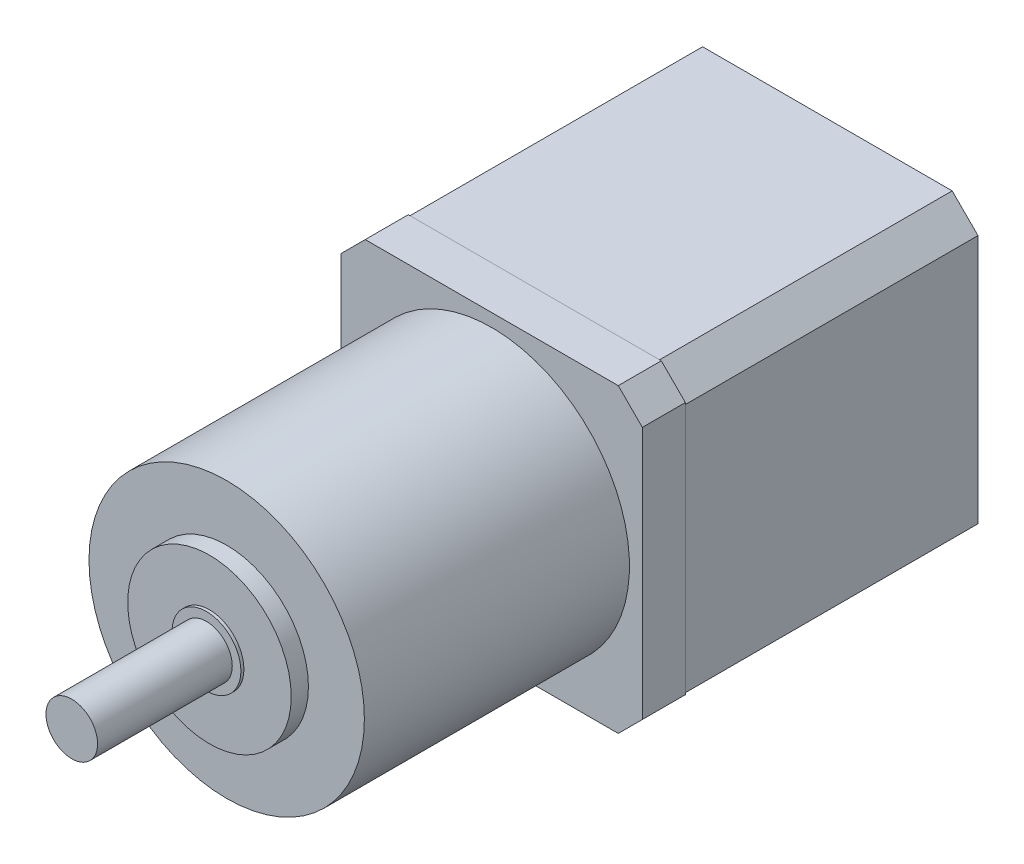
ISO-10303-21;
HEADER;
FILE_DESCRIPTION(('STEP AP214'),'2;1');
FILE_NAME('part.step','',(''),(''),'','','');
FILE_SCHEMA(('AUTOMOTIVE_DESIGN { 1 0 10303 214 1 1 1 1 }'));
ENDSEC;
DATA;
#1=APPLICATION_CONTEXT('core data for automotive mechanical design processes');
#2=APPLICATION_PROTOCOL_DEFINITION('international standard','automotive_design',2000,#1);
#3=PRODUCT_CONTEXT('',#1,'mechanical');
#4=PRODUCT('Part','Part','',(#3));
#5=PRODUCT_RELATED_PRODUCT_CATEGORY('part','',(#4));
#6=PRODUCT_DEFINITION_FORMATION('','',#4);
#7=PRODUCT_DEFINITION_CONTEXT('part definition',#1,'design');
#8=PRODUCT_DEFINITION('design','',#6,#7);
#9=PRODUCT_DEFINITION_SHAPE('','',#8);
#10=(LENGTH_UNIT() NAMED_UNIT(*) SI_UNIT(.MILLI.,.METRE.));
#11=(NAMED_UNIT(*) PLANE_ANGLE_UNIT() SI_UNIT($,.RADIAN.));
#12=(NAMED_UNIT(*) SI_UNIT($,.STERADIAN.) SOLID_ANGLE_UNIT());
#13=UNCERTAINTY_MEASURE_WITH_UNIT(LENGTH_MEASURE(1.E-05),#10,'distance_accuracy_value','');
#14=(GEOMETRIC_REPRESENTATION_CONTEXT(3) GLOBAL_UNCERTAINTY_ASSIGNED_CONTEXT((#13)) GLOBAL_UNIT_ASSIGNED_CONTEXT((#10,
#11,#12)) REPRESENTATION_CONTEXT('',''));
#15=CARTESIAN_POINT('',(0.,0.,0.));
#16=DIRECTION('',(0.,0.,1.));
#17=DIRECTION('',(1.,0.,0.));
#18=AXIS2_PLACEMENT_3D('',#15,#16,#17);
#19=CARTESIAN_POINT('',(17.5,-17.5,39.));
#20=DIRECTION('',(-1.,0.,0.));
#21=DIRECTION('',(0.,0.,1.));
#22=AXIS2_PLACEMENT_3D('',#19,#20,#21);
#23=PLANE('',#22);
#24=DIRECTION('',(0.,1.,0.));
#25=VECTOR('',#24,1.);
#26=CARTESIAN_POINT('',(17.5,-17.5,39.));
#27=LINE('',#26,#25);
#28=CARTESIAN_POINT('',(17.5,-14.7,39.));
#29=VERTEX_POINT('',#28);
#30=CARTESIAN_POINT('',(17.5,14.7,39.));
#31=VERTEX_POINT('',#30);
#32=EDGE_CURVE('E135',#29,#31,#27,.T.);
#33=ORIENTED_EDGE('',*,*,#32,.F.);
#34=DIRECTION('',(0.,0.,-1.));
#35=VECTOR('',#34,1.);
#36=CARTESIAN_POINT('',(17.5,-14.7,39.));
#37=LINE('',#36,#35);
#38=CARTESIAN_POINT('',(17.5,-14.7,34.));
#39=VERTEX_POINT('',#38);
#40=EDGE_CURVE('E161',#29,#39,#37,.T.);
#41=ORIENTED_EDGE('',*,*,#40,.T.);
#42=DIRECTION('',(0.,1.,0.));
#43=VECTOR('',#42,1.);
#44=CARTESIAN_POINT('',(17.5,-17.5,34.));
#45=LINE('',#44,#43);
#46=CARTESIAN_POINT('',(17.5,14.7,34.));
#47=VERTEX_POINT('',#46);
#48=EDGE_CURVE('E172',#39,#47,#45,.T.);
#49=ORIENTED_EDGE('',*,*,#48,.T.);
#50=DIRECTION('',(0.,0.,1.));
#51=VECTOR('',#50,1.);
#52=CARTESIAN_POINT('',(17.5,14.7,39.));
#53=LINE('',#52,#51);
#54=EDGE_CURVE('E159',#47,#31,#53,.T.);
#55=ORIENTED_EDGE('',*,*,#54,.T.);
#56=EDGE_LOOP('',(#33,#41,#49,#55));
#57=FACE_BOUND('',#56,.T.);
#58=ADVANCED_FACE('F42',(#57),#23,.F.);
#59=CARTESIAN_POINT('',(-17.5,17.5,39.));
#60=DIRECTION('',(0.,-1.,0.));
#61=DIRECTION('',(0.,0.,-1.));
#62=AXIS2_PLACEMENT_3D('',#59,#60,#61);
#63=PLANE('',#62);
#64=DIRECTION('',(-1.,0.,0.));
#65=VECTOR('',#64,1.);
#66=CARTESIAN_POINT('',(-17.5,17.5,34.));
#67=LINE('',#66,#65);
#68=CARTESIAN_POINT('',(14.7,17.5,34.));
#69=VERTEX_POINT('',#68);
#70=CARTESIAN_POINT('',(-14.7,17.5,34.));
#71=VERTEX_POINT('',#70);
#72=EDGE_CURVE('E140',#69,#71,#67,.T.);
#73=ORIENTED_EDGE('',*,*,#72,.T.);
#74=DIRECTION('',(0.,0.,1.));
#75=VECTOR('',#74,1.);
#76=CARTESIAN_POINT('',(-14.7,17.5,39.));
#77=LINE('',#76,#75);
#78=CARTESIAN_POINT('',(-14.7,17.5,39.));
#79=VERTEX_POINT('',#78);
#80=EDGE_CURVE('E51',#71,#79,#77,.T.);
#81=ORIENTED_EDGE('',*,*,#80,.T.);
#82=DIRECTION('',(-1.,0.,0.));
#83=VECTOR('',#82,1.);
#84=CARTESIAN_POINT('',(-17.5,17.5,39.));
#85=LINE('',#84,#83);
#86=CARTESIAN_POINT('',(14.7,17.5,39.));
#87=VERTEX_POINT('',#86);
#88=EDGE_CURVE('E138',#87,#79,#85,.T.);
#89=ORIENTED_EDGE('',*,*,#88,.F.);
#90=DIRECTION('',(0.,0.,-1.));
#91=VECTOR('',#90,1.);
#92=CARTESIAN_POINT('',(14.7,17.5,39.));
#93=LINE('',#92,#91);
#94=EDGE_CURVE('E164',#87,#69,#93,.T.);
#95=ORIENTED_EDGE('',*,*,#94,.T.);
#96=EDGE_LOOP('',(#73,#81,#89,#95));
#97=FACE_BOUND('',#96,.T.);
#98=ADVANCED_FACE('F169',(#97),#63,.F.);
#99=CARTESIAN_POINT('',(-17.5,-17.5,39.));
#100=DIRECTION('',(1.,0.,0.));
#101=DIRECTION('',(0.,0.,-1.));
#102=AXIS2_PLACEMENT_3D('',#99,#100,#101);
#103=PLANE('',#102);
#104=DIRECTION('',(0.,-1.,0.));
#105=VECTOR('',#104,1.);
#106=CARTESIAN_POINT('',(-17.5,-17.5,34.));
#107=LINE('',#106,#105);
#108=CARTESIAN_POINT('',(-17.5,14.7,34.));
#109=VERTEX_POINT('',#108);
#110=CARTESIAN_POINT('',(-17.5,-14.7,34.));
#111=VERTEX_POINT('',#110);
#112=EDGE_CURVE('E136',#109,#111,#107,.T.);
#113=ORIENTED_EDGE('',*,*,#112,.T.);
#114=DIRECTION('',(0.,0.,1.));
#115=VECTOR('',#114,1.);
#116=CARTESIAN_POINT('',(-17.5,-14.7,39.));
#117=LINE('',#116,#115);
#118=CARTESIAN_POINT('',(-17.5,-14.7,39.));
#119=VERTEX_POINT('',#118);
#120=EDGE_CURVE('E114',#111,#119,#117,.T.);
#121=ORIENTED_EDGE('',*,*,#120,.T.);
#122=DIRECTION('',(0.,-1.,0.));
#123=VECTOR('',#122,1.);
#124=CARTESIAN_POINT('',(-17.5,-17.5,39.));
#125=LINE('',#124,#123);
#126=CARTESIAN_POINT('',(-17.5,14.7,39.));
#127=VERTEX_POINT('',#126);
#128=EDGE_CURVE('E177',#127,#119,#125,.T.);
#129=ORIENTED_EDGE('',*,*,#128,.F.);
#130=DIRECTION('',(0.,0.,-1.));
#131=VECTOR('',#130,1.);
#132=CARTESIAN_POINT('',(-17.5,14.7,39.));
#133=LINE('',#132,#131);
#134=EDGE_CURVE('E119',#127,#109,#133,.T.);
#135=ORIENTED_EDGE('',*,*,#134,.T.);
#136=EDGE_LOOP('',(#113,#121,#129,#135));
#137=FACE_BOUND('',#136,.T.);
#138=ADVANCED_FACE('F225',(#137),#103,.F.);
#139=CARTESIAN_POINT('',(-17.5,-17.5,39.));
#140=DIRECTION('',(0.,1.,0.));
#141=DIRECTION('',(0.,0.,1.));
#142=AXIS2_PLACEMENT_3D('',#139,#140,#141);
#143=PLANE('',#142);
#144=DIRECTION('',(1.,0.,0.));
#145=VECTOR('',#144,1.);
#146=CARTESIAN_POINT('',(-17.5,-17.5,39.));
#147=LINE('',#146,#145);
#148=CARTESIAN_POINT('',(-14.7,-17.5,39.));
#149=VERTEX_POINT('',#148);
#150=CARTESIAN_POINT('',(14.7,-17.5,39.));
#151=VERTEX_POINT('',#150);
#152=EDGE_CURVE('E129',#149,#151,#147,.T.);
#153=ORIENTED_EDGE('',*,*,#152,.F.);
#154=DIRECTION('',(0.,0.,-1.));
#155=VECTOR('',#154,1.);
#156=CARTESIAN_POINT('',(-14.7,-17.5,39.));
#157=LINE('',#156,#155);
#158=CARTESIAN_POINT('',(-14.7,-17.5,34.));
#159=VERTEX_POINT('',#158);
#160=EDGE_CURVE('E113',#149,#159,#157,.T.);
#161=ORIENTED_EDGE('',*,*,#160,.T.);
#162=DIRECTION('',(1.,0.,0.));
#163=VECTOR('',#162,1.);
#164=CARTESIAN_POINT('',(-17.5,-17.5,34.));
#165=LINE('',#164,#163);
#166=CARTESIAN_POINT('',(14.7,-17.5,34.));
#167=VERTEX_POINT('',#166);
#168=EDGE_CURVE('E126',#159,#167,#165,.T.);
#169=ORIENTED_EDGE('',*,*,#168,.T.);
#170=DIRECTION('',(0.,0.,1.));
#171=VECTOR('',#170,1.);
#172=CARTESIAN_POINT('',(14.7,-17.5,39.));
#173=LINE('',#172,#171);
#174=EDGE_CURVE('E131',#167,#151,#173,.T.);
#175=ORIENTED_EDGE('',*,*,#174,.T.);
#176=EDGE_LOOP('',(#153,#161,#169,#175));
#177=FACE_BOUND('',#176,.T.);
#178=ADVANCED_FACE('F125',(#177),#143,.F.);
#179=CARTESIAN_POINT('',(0.,0.,39.));
#180=DIRECTION('',(0.,0.,-1.));
#181=DIRECTION('',(-1.,0.,0.));
#182=AXIS2_PLACEMENT_3D('',#179,#180,#181);
#183=PLANE('',#182);
#184=CARTESIAN_POINT('',(0.,0.,39.));
#185=DIRECTION('',(0.,0.,-1.));
#186=DIRECTION('',(-1.,0.,0.));
#187=AXIS2_PLACEMENT_3D('',#184,#185,#186);
#188=CIRCLE('',#187,16.);
#189=CARTESIAN_POINT('',(-16.,0.,39.));
#190=VERTEX_POINT('',#189);
#191=EDGE_CURVE('E12',#190,#190,#188,.F.);
#192=ORIENTED_EDGE('',*,*,#191,.F.);
#193=EDGE_LOOP('',(#192));
#194=FACE_BOUND('',#193,.T.);
#195=ORIENTED_EDGE('',*,*,#128,.T.);
#196=DIRECTION('',(-0.707106781186547,0.707106781186548,0.));
#197=VECTOR('',#196,1.);
#198=CARTESIAN_POINT('',(-14.7,-17.5,39.));
#199=LINE('',#198,#197);
#200=EDGE_CURVE('E157',#119,#149,#199,.F.);
#201=ORIENTED_EDGE('',*,*,#200,.T.);
#202=ORIENTED_EDGE('',*,*,#152,.T.);
#203=DIRECTION('',(-0.707106781186548,-0.707106781186547,0.));
#204=VECTOR('',#203,1.);
#205=CARTESIAN_POINT('',(17.5,-14.7,39.));
#206=LINE('',#205,#204);
#207=EDGE_CURVE('E155',#151,#29,#206,.F.);
#208=ORIENTED_EDGE('',*,*,#207,.T.);
#209=ORIENTED_EDGE('',*,*,#32,.T.);
#210=DIRECTION('',(0.707106781186547,-0.707106781186548,0.));
#211=VECTOR('',#210,1.);
#212=CARTESIAN_POINT('',(14.7,17.5,39.));
#213=LINE('',#212,#211);
#214=EDGE_CURVE('E64',#31,#87,#213,.F.);
#215=ORIENTED_EDGE('',*,*,#214,.T.);
#216=ORIENTED_EDGE('',*,*,#88,.T.);
#217=DIRECTION('',(0.707106781186548,0.707106781186547,0.));
#218=VECTOR('',#217,1.);
#219=CARTESIAN_POINT('',(-17.5,14.7,39.));
#220=LINE('',#219,#218);
#221=EDGE_CURVE('E153',#79,#127,#220,.F.);
#222=ORIENTED_EDGE('',*,*,#221,.T.);
#223=EDGE_LOOP('',(#195,#201,#202,#208,#209,#215,#216,#222));
#224=FACE_BOUND('',#223,.T.);
#225=ADVANCED_FACE('F245',(#194,#224),#183,.F.);
#226=CARTESIAN_POINT('',(0.,0.,34.));
#227=DIRECTION('',(0.,0.,-1.));
#228=DIRECTION('',(-1.,0.,0.));
#229=AXIS2_PLACEMENT_3D('',#226,#227,#228);
#230=PLANE('',#229);
#231=ORIENTED_EDGE('',*,*,#168,.F.);
#232=DIRECTION('',(0.707106781186547,-0.707106781186548,0.));
#233=VECTOR('',#232,1.);
#234=CARTESIAN_POINT('',(-16.1,-16.1,34.));
#235=LINE('',#234,#233);
#236=EDGE_CURVE('E109',#159,#111,#235,.F.);
#237=ORIENTED_EDGE('',*,*,#236,.T.);
#238=ORIENTED_EDGE('',*,*,#112,.F.);
#239=DIRECTION('',(-0.707106781186548,-0.707106781186547,0.));
#240=VECTOR('',#239,1.);
#241=CARTESIAN_POINT('',(-16.1,16.1,34.));
#242=LINE('',#241,#240);
#243=EDGE_CURVE('E146',#109,#71,#242,.F.);
#244=ORIENTED_EDGE('',*,*,#243,.T.);
#245=ORIENTED_EDGE('',*,*,#72,.F.);
#246=DIRECTION('',(-0.707106781186547,0.707106781186548,0.));
#247=VECTOR('',#246,1.);
#248=CARTESIAN_POINT('',(16.1,16.1,34.));
#249=LINE('',#248,#247);
#250=EDGE_CURVE('E130',#69,#47,#249,.F.);
#251=ORIENTED_EDGE('',*,*,#250,.T.);
#252=ORIENTED_EDGE('',*,*,#48,.F.);
#253=DIRECTION('',(0.707106781186548,0.707106781186547,0.));
#254=VECTOR('',#253,1.);
#255=CARTESIAN_POINT('',(16.1,-16.1,34.));
#256=LINE('',#255,#254);
#257=EDGE_CURVE('E120',#39,#167,#256,.F.);
#258=ORIENTED_EDGE('',*,*,#257,.T.);
#259=EDGE_LOOP('',(#231,#237,#238,#244,#245,#251,#252,#258));
#260=FACE_BOUND('',#259,.T.);
#261=ADVANCED_FACE('F133',(#260),#230,.T.);
#262=CARTESIAN_POINT('',(-14.7,-17.5,39.));
#263=DIRECTION('',(0.707106781186548,0.707106781186547,0.));
#264=DIRECTION('',(0.,0.,-1.));
#265=AXIS2_PLACEMENT_3D('',#262,#263,#264);
#266=PLANE('',#265);
#267=ORIENTED_EDGE('',*,*,#200,.F.);
#268=ORIENTED_EDGE('',*,*,#120,.F.);
#269=ORIENTED_EDGE('',*,*,#236,.F.);
#270=ORIENTED_EDGE('',*,*,#160,.F.);
#271=EDGE_LOOP('',(#267,#268,#269,#270));
#272=FACE_BOUND('',#271,.T.);
#273=ADVANCED_FACE('F112',(#272),#266,.F.);
#274=CARTESIAN_POINT('',(17.5,-14.7,39.));
#275=DIRECTION('',(-0.707106781186547,0.707106781186548,0.));
#276=DIRECTION('',(0.,0.,-1.));
#277=AXIS2_PLACEMENT_3D('',#274,#275,#276);
#278=PLANE('',#277);
#279=ORIENTED_EDGE('',*,*,#207,.F.);
#280=ORIENTED_EDGE('',*,*,#174,.F.);
#281=ORIENTED_EDGE('',*,*,#257,.F.);
#282=ORIENTED_EDGE('',*,*,#40,.F.);
#283=EDGE_LOOP('',(#279,#280,#281,#282));
#284=FACE_BOUND('',#283,.T.);
#285=ADVANCED_FACE('F232',(#284),#278,.F.);
#286=CARTESIAN_POINT('',(-17.5,14.7,39.));
#287=DIRECTION('',(0.707106781186547,-0.707106781186548,0.));
#288=DIRECTION('',(0.,0.,-1.));
#289=AXIS2_PLACEMENT_3D('',#286,#287,#288);
#290=PLANE('',#289);
#291=ORIENTED_EDGE('',*,*,#221,.F.);
#292=ORIENTED_EDGE('',*,*,#80,.F.);
#293=ORIENTED_EDGE('',*,*,#243,.F.);
#294=ORIENTED_EDGE('',*,*,#134,.F.);
#295=EDGE_LOOP('',(#291,#292,#293,#294));
#296=FACE_BOUND('',#295,.T.);
#297=ADVANCED_FACE('F234',(#296),#290,.F.);
#298=CARTESIAN_POINT('',(14.7,17.5,39.));
#299=DIRECTION('',(-0.707106781186548,-0.707106781186547,0.));
#300=DIRECTION('',(0.,0.,-1.));
#301=AXIS2_PLACEMENT_3D('',#298,#299,#300);
#302=PLANE('',#301);
#303=ORIENTED_EDGE('',*,*,#214,.F.);
#304=ORIENTED_EDGE('',*,*,#54,.F.);
#305=ORIENTED_EDGE('',*,*,#250,.F.);
#306=ORIENTED_EDGE('',*,*,#94,.F.);
#307=EDGE_LOOP('',(#303,#304,#305,#306));
#308=FACE_BOUND('',#307,.T.);
#309=ADVANCED_FACE('F44',(#308),#302,.F.);
#310=CARTESIAN_POINT('',(0.,0.,69.8));
#311=DIRECTION('',(0.,0.,-1.));
#312=DIRECTION('',(-1.,0.,0.));
#313=AXIS2_PLACEMENT_3D('',#310,#311,#312);
#314=CYLINDRICAL_SURFACE('',#313,16.);
#315=CARTESIAN_POINT('',(0.,0.,69.8));
#316=DIRECTION('',(0.,0.,1.));
#317=DIRECTION('',(1.,0.,0.));
#318=AXIS2_PLACEMENT_3D('',#315,#316,#317);
#319=CIRCLE('',#318,16.);
#320=CARTESIAN_POINT('',(16.,0.,69.8));
#321=VERTEX_POINT('',#320);
#322=EDGE_CURVE('E173',#321,#321,#319,.T.);
#323=ORIENTED_EDGE('',*,*,#322,.F.);
#324=EDGE_LOOP('',(#323));
#325=FACE_BOUND('',#324,.T.);
#326=ORIENTED_EDGE('',*,*,#191,.T.);
#327=EDGE_LOOP('',(#326));
#328=FACE_BOUND('',#327,.T.);
#329=ADVANCED_FACE('F241',(#325,#328),#314,.T.);
#330=CARTESIAN_POINT('',(0.,0.,69.8));
#331=DIRECTION('',(0.,0.,1.));
#332=DIRECTION('',(1.,0.,0.));
#333=AXIS2_PLACEMENT_3D('',#330,#331,#332);
#334=PLANE('',#333);
#335=CARTESIAN_POINT('',(0.,0.,69.8));
#336=DIRECTION('',(0.,0.,1.));
#337=DIRECTION('',(1.,0.,0.));
#338=AXIS2_PLACEMENT_3D('',#335,#336,#337);
#339=CIRCLE('',#338,9.5);
#340=CARTESIAN_POINT('',(9.5,0.,69.8));
#341=VERTEX_POINT('',#340);
#342=EDGE_CURVE('E184',#341,#341,#339,.T.);
#343=ORIENTED_EDGE('',*,*,#342,.F.);
#344=EDGE_LOOP('',(#343));
#345=FACE_BOUND('',#344,.T.);
#346=ORIENTED_EDGE('',*,*,#322,.T.);
#347=EDGE_LOOP('',(#346));
#348=FACE_BOUND('',#347,.T.);
#349=ADVANCED_FACE('F260',(#345,#348),#334,.T.);
#350=CARTESIAN_POINT('',(0.,0.,71.8));
#351=DIRECTION('',(0.,0.,-1.));
#352=DIRECTION('',(-1.,0.,0.));
#353=AXIS2_PLACEMENT_3D('',#350,#351,#352);
#354=CYLINDRICAL_SURFACE('',#353,9.5);
#355=CARTESIAN_POINT('',(0.,0.,71.8));
#356=DIRECTION('',(0.,0.,1.));
#357=DIRECTION('',(1.,0.,0.));
#358=AXIS2_PLACEMENT_3D('',#355,#356,#357);
#359=CIRCLE('',#358,9.5);
#360=CARTESIAN_POINT('',(9.5,0.,71.8));
#361=VERTEX_POINT('',#360);
#362=EDGE_CURVE('E183',#361,#361,#359,.T.);
#363=ORIENTED_EDGE('',*,*,#362,.F.);
#364=EDGE_LOOP('',(#363));
#365=FACE_BOUND('',#364,.T.);
#366=ORIENTED_EDGE('',*,*,#342,.T.);
#367=EDGE_LOOP('',(#366));
#368=FACE_BOUND('',#367,.T.);
#369=ADVANCED_FACE('F264',(#365,#368),#354,.T.);
#370=CARTESIAN_POINT('',(0.,0.,71.8));
#371=DIRECTION('',(0.,0.,1.));
#372=DIRECTION('',(1.,0.,0.));
#373=AXIS2_PLACEMENT_3D('',#370,#371,#372);
#374=PLANE('',#373);
#375=CARTESIAN_POINT('',(0.,0.,71.8));
#376=DIRECTION('',(0.,0.,1.));
#377=DIRECTION('',(1.,0.,0.));
#378=AXIS2_PLACEMENT_3D('',#375,#376,#377);
#379=CIRCLE('',#378,4.);
#380=CARTESIAN_POINT('',(4.,0.,71.8));
#381=VERTEX_POINT('',#380);
#382=EDGE_CURVE('E192',#381,#381,#379,.T.);
#383=ORIENTED_EDGE('',*,*,#382,.F.);
#384=EDGE_LOOP('',(#383));
#385=FACE_BOUND('',#384,.T.);
#386=ORIENTED_EDGE('',*,*,#362,.T.);
#387=EDGE_LOOP('',(#386));
#388=FACE_BOUND('',#387,.T.);
#389=ADVANCED_FACE('F216',(#385,#388),#374,.T.);
#390=CARTESIAN_POINT('',(0.,0.,72.15));
#391=DIRECTION('',(0.,0.,-1.));
#392=DIRECTION('',(-1.,0.,0.));
#393=AXIS2_PLACEMENT_3D('',#390,#391,#392);
#394=CYLINDRICAL_SURFACE('',#393,4.);
#395=CARTESIAN_POINT('',(0.,0.,72.15));
#396=DIRECTION('',(0.,0.,1.));
#397=DIRECTION('',(1.,0.,0.));
#398=AXIS2_PLACEMENT_3D('',#395,#396,#397);
#399=CIRCLE('',#398,4.);
#400=CARTESIAN_POINT('',(4.,0.,72.15));
#401=VERTEX_POINT('',#400);
#402=EDGE_CURVE('E195',#401,#401,#399,.T.);
#403=ORIENTED_EDGE('',*,*,#402,.F.);
#404=EDGE_LOOP('',(#403));
#405=FACE_BOUND('',#404,.T.);
#406=ORIENTED_EDGE('',*,*,#382,.T.);
#407=EDGE_LOOP('',(#406));
#408=FACE_BOUND('',#407,.T.);
#409=ADVANCED_FACE('F208',(#405,#408),#394,.T.);
#410=CARTESIAN_POINT('',(0.,0.,72.15));
#411=DIRECTION('',(0.,0.,1.));
#412=DIRECTION('',(1.,0.,0.));
#413=AXIS2_PLACEMENT_3D('',#410,#411,#412);
#414=PLANE('',#413);
#415=CARTESIAN_POINT('',(0.,0.,72.15));
#416=DIRECTION('',(0.,0.,1.));
#417=DIRECTION('',(1.,0.,0.));
#418=AXIS2_PLACEMENT_3D('',#415,#416,#417);
#419=CIRCLE('',#418,3.);
#420=CARTESIAN_POINT('',(3.,0.,72.15));
#421=VERTEX_POINT('',#420);
#422=EDGE_CURVE('E46',#421,#421,#419,.T.);
#423=ORIENTED_EDGE('',*,*,#422,.F.);
#424=EDGE_LOOP('',(#423));
#425=FACE_BOUND('',#424,.T.);
#426=ORIENTED_EDGE('',*,*,#402,.T.);
#427=EDGE_LOOP('',(#426));
#428=FACE_BOUND('',#427,.T.);
#429=ADVANCED_FACE('F205',(#425,#428),#414,.T.);
#430=CARTESIAN_POINT('',(0.,0.,87.8));
#431=DIRECTION('',(0.,0.,1.));
#432=DIRECTION('',(1.,0.,0.));
#433=AXIS2_PLACEMENT_3D('',#430,#431,#432);
#434=PLANE('',#433);
#435=CARTESIAN_POINT('',(0.,0.,87.8));
#436=DIRECTION('',(0.,0.,1.));
#437=DIRECTION('',(1.,0.,0.));
#438=AXIS2_PLACEMENT_3D('',#435,#436,#437);
#439=CIRCLE('',#438,3.);
#440=CARTESIAN_POINT('',(3.,0.,87.8));
#441=VERTEX_POINT('',#440);
#442=EDGE_CURVE('E187',#441,#441,#439,.T.);
#443=ORIENTED_EDGE('',*,*,#442,.T.);
#444=EDGE_LOOP('',(#443));
#445=FACE_BOUND('',#444,.T.);
#446=ADVANCED_FACE('F207',(#445),#434,.T.);
#447=CARTESIAN_POINT('',(0.,0.,87.8));
#448=DIRECTION('',(0.,0.,-1.));
#449=DIRECTION('',(-1.,0.,0.));
#450=AXIS2_PLACEMENT_3D('',#447,#448,#449);
#451=CYLINDRICAL_SURFACE('',#450,3.);
#452=ORIENTED_EDGE('',*,*,#422,.T.);
#453=EDGE_LOOP('',(#452));
#454=FACE_BOUND('',#453,.T.);
#455=ORIENTED_EDGE('',*,*,#442,.F.);
#456=EDGE_LOOP('',(#455));
#457=FACE_BOUND('',#456,.T.);
#458=ADVANCED_FACE('F202',(#454,#457),#451,.T.);
#459=CLOSED_SHELL('',(#58,#98,#138,#178,#225,#261,#273,#285,#297,#309,#329,#349,#369,#389,#409,
#429,#446,#458));
#460=MANIFOLD_SOLID_BREP('B2',#459);
#461=CARTESIAN_POINT('',(17.5,17.5,34.));
#462=DIRECTION('',(-1.,0.,0.));
#463=DIRECTION('',(0.,-1.,0.));
#464=AXIS2_PLACEMENT_3D('',#461,#462,#463);
#465=PLANE('',#464);
#466=DIRECTION('',(0.,1.,0.));
#467=VECTOR('',#466,1.);
#468=CARTESIAN_POINT('',(17.5,17.5,34.));
#469=LINE('',#468,#467);
#470=CARTESIAN_POINT('',(17.5,-14.5,34.));
#471=VERTEX_POINT('',#470);
#472=CARTESIAN_POINT('',(17.5,14.5,34.));
#473=VERTEX_POINT('',#472);
#474=EDGE_CURVE('E480',#471,#473,#469,.T.);
#475=ORIENTED_EDGE('',*,*,#474,.F.);
#476=DIRECTION('',(0.,0.,-1.));
#477=VECTOR('',#476,1.);
#478=CARTESIAN_POINT('',(17.5,-14.5,34.));
#479=LINE('',#478,#477);
#480=CARTESIAN_POINT('',(17.5,-14.5,0.));
#481=VERTEX_POINT('',#480);
#482=EDGE_CURVE('E506',#471,#481,#479,.T.);
#483=ORIENTED_EDGE('',*,*,#482,.T.);
#484=DIRECTION('',(0.,1.,0.));
#485=VECTOR('',#484,1.);
#486=CARTESIAN_POINT('',(17.5,17.5,0.));
#487=LINE('',#486,#485);
#488=CARTESIAN_POINT('',(17.5,14.5,0.));
#489=VERTEX_POINT('',#488);
#490=EDGE_CURVE('E514',#481,#489,#487,.T.);
#491=ORIENTED_EDGE('',*,*,#490,.T.);
#492=DIRECTION('',(0.,0.,1.));
#493=VECTOR('',#492,1.);
#494=CARTESIAN_POINT('',(17.5,14.5,34.));
#495=LINE('',#494,#493);
#496=EDGE_CURVE('E504',#489,#473,#495,.T.);
#497=ORIENTED_EDGE('',*,*,#496,.T.);
#498=EDGE_LOOP('',(#475,#483,#491,#497));
#499=FACE_BOUND('',#498,.T.);
#500=ADVANCED_FACE('F389',(#499),#465,.F.);
#501=CARTESIAN_POINT('',(-17.5,17.5,34.));
#502=DIRECTION('',(0.,-1.,0.));
#503=DIRECTION('',(0.,0.,-1.));
#504=AXIS2_PLACEMENT_3D('',#501,#502,#503);
#505=PLANE('',#504);
#506=DIRECTION('',(-1.,0.,0.));
#507=VECTOR('',#506,1.);
#508=CARTESIAN_POINT('',(-17.5,17.5,0.));
#509=LINE('',#508,#507);
#510=CARTESIAN_POINT('',(14.5,17.5,0.));
#511=VERTEX_POINT('',#510);
#512=CARTESIAN_POINT('',(-14.5,17.5,0.));
#513=VERTEX_POINT('',#512);
#514=EDGE_CURVE('E485',#511,#513,#509,.T.);
#515=ORIENTED_EDGE('',*,*,#514,.T.);
#516=DIRECTION('',(0.,0.,1.));
#517=VECTOR('',#516,1.);
#518=CARTESIAN_POINT('',(-14.5,17.5,34.));
#519=LINE('',#518,#517);
#520=CARTESIAN_POINT('',(-14.5,17.5,34.));
#521=VERTEX_POINT('',#520);
#522=EDGE_CURVE('E40',#513,#521,#519,.T.);
#523=ORIENTED_EDGE('',*,*,#522,.T.);
#524=DIRECTION('',(-1.,0.,0.));
#525=VECTOR('',#524,1.);
#526=CARTESIAN_POINT('',(-17.5,17.5,34.));
#527=LINE('',#526,#525);
#528=CARTESIAN_POINT('',(14.5,17.5,34.));
#529=VERTEX_POINT('',#528);
#530=EDGE_CURVE('E483',#529,#521,#527,.T.);
#531=ORIENTED_EDGE('',*,*,#530,.F.);
#532=DIRECTION('',(0.,0.,-1.));
#533=VECTOR('',#532,1.);
#534=CARTESIAN_POINT('',(14.5,17.5,34.));
#535=LINE('',#534,#533);
#536=EDGE_CURVE('E397',#529,#511,#535,.T.);
#537=ORIENTED_EDGE('',*,*,#536,.T.);
#538=EDGE_LOOP('',(#515,#523,#531,#537));
#539=FACE_BOUND('',#538,.T.);
#540=ADVANCED_FACE('F511',(#539),#505,.F.);
#541=CARTESIAN_POINT('',(-17.5,17.5,34.));
#542=DIRECTION('',(1.,0.,0.));
#543=DIRECTION('',(0.,1.,0.));
#544=AXIS2_PLACEMENT_3D('',#541,#542,#543);
#545=PLANE('',#544);
#546=DIRECTION('',(0.,-1.,0.));
#547=VECTOR('',#546,1.);
#548=CARTESIAN_POINT('',(-17.5,17.5,0.));
#549=LINE('',#548,#547);
#550=CARTESIAN_POINT('',(-17.5,14.5,0.));
#551=VERTEX_POINT('',#550);
#552=CARTESIAN_POINT('',(-17.5,-14.5,0.));
#553=VERTEX_POINT('',#552);
#554=EDGE_CURVE('E481',#551,#553,#549,.T.);
#555=ORIENTED_EDGE('',*,*,#554,.T.);
#556=DIRECTION('',(0.,0.,1.));
#557=VECTOR('',#556,1.);
#558=CARTESIAN_POINT('',(-17.5,-14.5,34.));
#559=LINE('',#558,#557);
#560=CARTESIAN_POINT('',(-17.5,-14.5,34.));
#561=VERTEX_POINT('',#560);
#562=EDGE_CURVE('E459',#553,#561,#559,.T.);
#563=ORIENTED_EDGE('',*,*,#562,.T.);
#564=DIRECTION('',(0.,-1.,0.));
#565=VECTOR('',#564,1.);
#566=CARTESIAN_POINT('',(-17.5,17.5,34.));
#567=LINE('',#566,#565);
#568=CARTESIAN_POINT('',(-17.5,14.5,34.));
#569=VERTEX_POINT('',#568);
#570=EDGE_CURVE('E518',#569,#561,#567,.T.);
#571=ORIENTED_EDGE('',*,*,#570,.F.);
#572=DIRECTION('',(0.,0.,-1.));
#573=VECTOR('',#572,1.);
#574=CARTESIAN_POINT('',(-17.5,14.5,34.));
#575=LINE('',#574,#573);
#576=EDGE_CURVE('E464',#569,#551,#575,.T.);
#577=ORIENTED_EDGE('',*,*,#576,.T.);
#578=EDGE_LOOP('',(#555,#563,#571,#577));
#579=FACE_BOUND('',#578,.T.);
#580=ADVANCED_FACE('F528',(#579),#545,.F.);
#581=CARTESIAN_POINT('',(-17.5,-17.5,34.));
#582=DIRECTION('',(0.,1.,0.));
#583=DIRECTION('',(0.,0.,1.));
#584=AXIS2_PLACEMENT_3D('',#581,#582,#583);
#585=PLANE('',#584);
#586=DIRECTION('',(1.,0.,0.));
#587=VECTOR('',#586,1.);
#588=CARTESIAN_POINT('',(-17.5,-17.5,34.));
#589=LINE('',#588,#587);
#590=CARTESIAN_POINT('',(-14.5,-17.5,34.));
#591=VERTEX_POINT('',#590);
#592=CARTESIAN_POINT('',(14.5,-17.5,34.));
#593=VERTEX_POINT('',#592);
#594=EDGE_CURVE('E474',#591,#593,#589,.T.);
#595=ORIENTED_EDGE('',*,*,#594,.F.);
#596=DIRECTION('',(0.,0.,-1.));
#597=VECTOR('',#596,1.);
#598=CARTESIAN_POINT('',(-14.5,-17.5,34.));
#599=LINE('',#598,#597);
#600=CARTESIAN_POINT('',(-14.5,-17.5,0.));
#601=VERTEX_POINT('',#600);
#602=EDGE_CURVE('E458',#591,#601,#599,.T.);
#603=ORIENTED_EDGE('',*,*,#602,.T.);
#604=DIRECTION('',(1.,0.,0.));
#605=VECTOR('',#604,1.);
#606=CARTESIAN_POINT('',(-17.5,-17.5,0.));
#607=LINE('',#606,#605);
#608=CARTESIAN_POINT('',(14.5,-17.5,0.));
#609=VERTEX_POINT('',#608);
#610=EDGE_CURVE('E471',#601,#609,#607,.T.);
#611=ORIENTED_EDGE('',*,*,#610,.T.);
#612=DIRECTION('',(0.,0.,1.));
#613=VECTOR('',#612,1.);
#614=CARTESIAN_POINT('',(14.5,-17.5,34.));
#615=LINE('',#614,#613);
#616=EDGE_CURVE('E476',#609,#593,#615,.T.);
#617=ORIENTED_EDGE('',*,*,#616,.T.);
#618=EDGE_LOOP('',(#595,#603,#611,#617));
#619=FACE_BOUND('',#618,.T.);
#620=ADVANCED_FACE('F470',(#619),#585,.F.);
#621=CARTESIAN_POINT('',(0.,0.,34.));
#622=DIRECTION('',(0.,0.,1.));
#623=DIRECTION('',(1.,0.,0.));
#624=AXIS2_PLACEMENT_3D('',#621,#622,#623);
#625=PLANE('',#624);
#626=ORIENTED_EDGE('',*,*,#570,.T.);
#627=DIRECTION('',(-0.707106781186546,0.707106781186549,0.));
#628=VECTOR('',#627,1.);
#629=CARTESIAN_POINT('',(-16.,-16.,34.));
#630=LINE('',#629,#628);
#631=EDGE_CURVE('E502',#561,#591,#630,.F.);
#632=ORIENTED_EDGE('',*,*,#631,.T.);
#633=ORIENTED_EDGE('',*,*,#594,.T.);
#634=DIRECTION('',(-0.70710678118655,-0.707106781186546,0.));
#635=VECTOR('',#634,1.);
#636=CARTESIAN_POINT('',(16.,-16.,34.));
#637=LINE('',#636,#635);
#638=EDGE_CURVE('E500',#593,#471,#637,.F.);
#639=ORIENTED_EDGE('',*,*,#638,.T.);
#640=ORIENTED_EDGE('',*,*,#474,.T.);
#641=DIRECTION('',(0.707106781186546,-0.707106781186549,0.));
#642=VECTOR('',#641,1.);
#643=CARTESIAN_POINT('',(16.,16.,34.));
#644=LINE('',#643,#642);
#645=EDGE_CURVE('E409',#473,#529,#644,.F.);
#646=ORIENTED_EDGE('',*,*,#645,.T.);
#647=ORIENTED_EDGE('',*,*,#530,.T.);
#648=DIRECTION('',(0.707106781186549,0.707106781186546,0.));
#649=VECTOR('',#648,1.);
#650=CARTESIAN_POINT('',(-16.,16.,34.));
#651=LINE('',#650,#649);
#652=EDGE_CURVE('E498',#521,#569,#651,.F.);
#653=ORIENTED_EDGE('',*,*,#652,.T.);
#654=EDGE_LOOP('',(#626,#632,#633,#639,#640,#646,#647,#653));
#655=FACE_BOUND('',#654,.T.);
#656=ADVANCED_FACE('F522',(#655),#625,.T.);
#657=CARTESIAN_POINT('',(0.,0.,0.));
#658=DIRECTION('',(0.,0.,1.));
#659=DIRECTION('',(1.,0.,0.));
#660=AXIS2_PLACEMENT_3D('',#657,#658,#659);
#661=PLANE('',#660);
#662=ORIENTED_EDGE('',*,*,#610,.F.);
#663=DIRECTION('',(0.707106781186546,-0.707106781186549,0.));
#664=VECTOR('',#663,1.);
#665=CARTESIAN_POINT('',(-14.5,-17.5,0.));
#666=LINE('',#665,#664);
#667=EDGE_CURVE('E454',#601,#553,#666,.F.);
#668=ORIENTED_EDGE('',*,*,#667,.T.);
#669=ORIENTED_EDGE('',*,*,#554,.F.);
#670=DIRECTION('',(-0.707106781186549,-0.707106781186546,0.));
#671=VECTOR('',#670,1.);
#672=CARTESIAN_POINT('',(-17.5,14.5,0.));
#673=LINE('',#672,#671);
#674=EDGE_CURVE('E491',#551,#513,#673,.F.);
#675=ORIENTED_EDGE('',*,*,#674,.T.);
#676=ORIENTED_EDGE('',*,*,#514,.F.);
#677=DIRECTION('',(-0.707106781186546,0.707106781186549,0.));
#678=VECTOR('',#677,1.);
#679=CARTESIAN_POINT('',(14.5,17.5,0.));
#680=LINE('',#679,#678);
#681=EDGE_CURVE('E475',#511,#489,#680,.F.);
#682=ORIENTED_EDGE('',*,*,#681,.T.);
#683=ORIENTED_EDGE('',*,*,#490,.F.);
#684=DIRECTION('',(0.70710678118655,0.707106781186546,0.));
#685=VECTOR('',#684,1.);
#686=CARTESIAN_POINT('',(17.5,-14.5,0.));
#687=LINE('',#686,#685);
#688=EDGE_CURVE('E465',#481,#609,#687,.F.);
#689=ORIENTED_EDGE('',*,*,#688,.T.);
#690=EDGE_LOOP('',(#662,#668,#669,#675,#676,#682,#683,#689));
#691=FACE_BOUND('',#690,.T.);
#692=ADVANCED_FACE('F478',(#691),#661,.F.);
#693=CARTESIAN_POINT('',(-14.5,-17.5,34.));
#694=DIRECTION('',(0.707106781186549,0.707106781186546,0.));
#695=DIRECTION('',(0.,0.,-1.));
#696=AXIS2_PLACEMENT_3D('',#693,#694,#695);
#697=PLANE('',#696);
#698=ORIENTED_EDGE('',*,*,#631,.F.);
#699=ORIENTED_EDGE('',*,*,#562,.F.);
#700=ORIENTED_EDGE('',*,*,#667,.F.);
#701=ORIENTED_EDGE('',*,*,#602,.F.);
#702=EDGE_LOOP('',(#698,#699,#700,#701));
#703=FACE_BOUND('',#702,.T.);
#704=ADVANCED_FACE('F457',(#703),#697,.F.);
#705=CARTESIAN_POINT('',(17.5,-14.5,34.));
#706=DIRECTION('',(-0.707106781186546,0.70710678118655,0.));
#707=DIRECTION('',(0.,0.,-1.));
#708=AXIS2_PLACEMENT_3D('',#705,#706,#707);
#709=PLANE('',#708);
#710=ORIENTED_EDGE('',*,*,#638,.F.);
#711=ORIENTED_EDGE('',*,*,#616,.F.);
#712=ORIENTED_EDGE('',*,*,#688,.F.);
#713=ORIENTED_EDGE('',*,*,#482,.F.);
#714=EDGE_LOOP('',(#710,#711,#712,#713));
#715=FACE_BOUND('',#714,.T.);
#716=ADVANCED_FACE('F533',(#715),#709,.F.);
#717=CARTESIAN_POINT('',(-17.5,14.5,34.));
#718=DIRECTION('',(0.707106781186546,-0.707106781186549,0.));
#719=DIRECTION('',(0.,0.,-1.));
#720=AXIS2_PLACEMENT_3D('',#717,#718,#719);
#721=PLANE('',#720);
#722=ORIENTED_EDGE('',*,*,#652,.F.);
#723=ORIENTED_EDGE('',*,*,#522,.F.);
#724=ORIENTED_EDGE('',*,*,#674,.F.);
#725=ORIENTED_EDGE('',*,*,#576,.F.);
#726=EDGE_LOOP('',(#722,#723,#724,#725));
#727=FACE_BOUND('',#726,.T.);
#728=ADVANCED_FACE('F526',(#727),#721,.F.);
#729=CARTESIAN_POINT('',(14.5,17.5,34.));
#730=DIRECTION('',(-0.707106781186549,-0.707106781186546,0.));
#731=DIRECTION('',(0.,0.,-1.));
#732=AXIS2_PLACEMENT_3D('',#729,#730,#731);
#733=PLANE('',#732);
#734=ORIENTED_EDGE('',*,*,#645,.F.);
#735=ORIENTED_EDGE('',*,*,#496,.F.);
#736=ORIENTED_EDGE('',*,*,#681,.F.);
#737=ORIENTED_EDGE('',*,*,#536,.F.);
#738=EDGE_LOOP('',(#734,#735,#736,#737));
#739=FACE_BOUND('',#738,.T.);
#740=ADVANCED_FACE('F391',(#739),#733,.F.);
#741=CLOSED_SHELL('',(#500,#540,#580,#620,#656,#692,#704,#716,#728,#740));
#742=MANIFOLD_SOLID_BREP('B6',#741);
#743=ADVANCED_BREP_SHAPE_REPRESENTATION('',(#18,#460,#742),#14);
#744=SHAPE_DEFINITION_REPRESENTATION(#9,#743);
ENDSEC;
END-ISO-10303-21;
